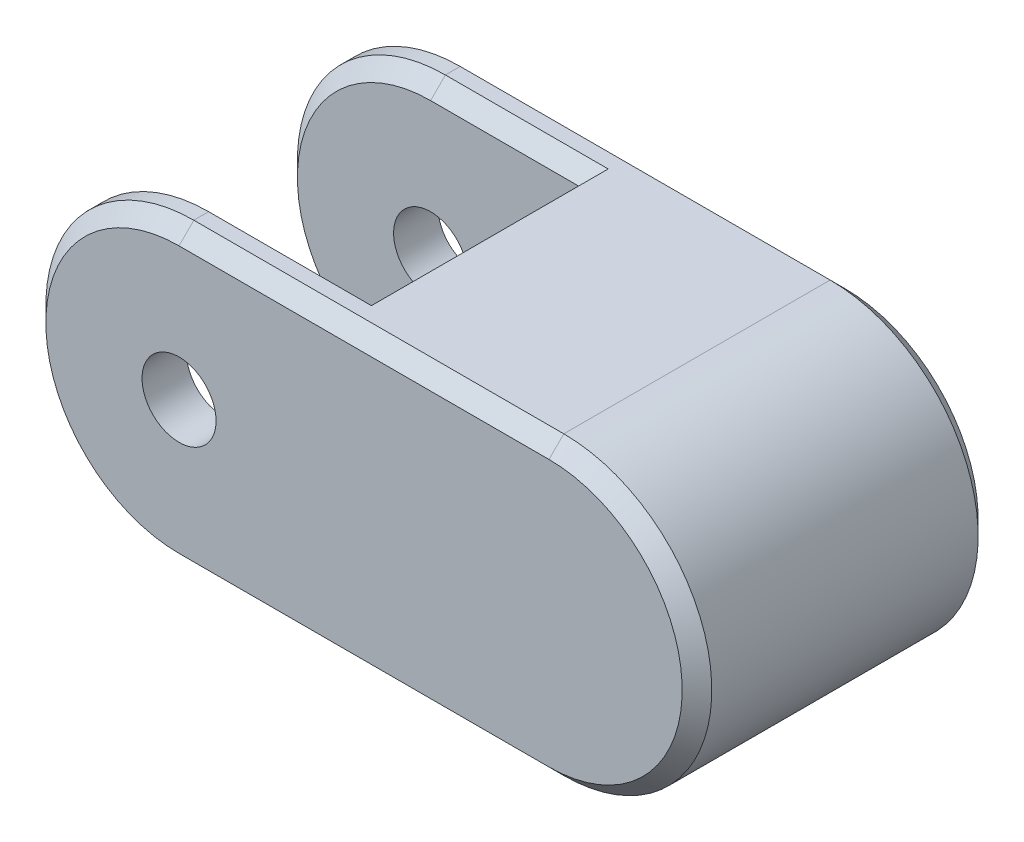
ISO-10303-21;
HEADER;
FILE_DESCRIPTION(('STEP AP214'),'2;1');
FILE_NAME('part.step','',(''),(''),'','','');
FILE_SCHEMA(('AUTOMOTIVE_DESIGN { 1 0 10303 214 1 1 1 1 }'));
ENDSEC;
DATA;
#1=APPLICATION_CONTEXT('core data for automotive mechanical design processes');
#2=APPLICATION_PROTOCOL_DEFINITION('international standard','automotive_design',2000,#1);
#3=PRODUCT_CONTEXT('',#1,'mechanical');
#4=PRODUCT('Part','Part','',(#3));
#5=PRODUCT_RELATED_PRODUCT_CATEGORY('part','',(#4));
#6=PRODUCT_DEFINITION_FORMATION('','',#4);
#7=PRODUCT_DEFINITION_CONTEXT('part definition',#1,'design');
#8=PRODUCT_DEFINITION('design','',#6,#7);
#9=PRODUCT_DEFINITION_SHAPE('','',#8);
#10=(LENGTH_UNIT() NAMED_UNIT(*) SI_UNIT(.MILLI.,.METRE.));
#11=(NAMED_UNIT(*) PLANE_ANGLE_UNIT() SI_UNIT($,.RADIAN.));
#12=(NAMED_UNIT(*) SI_UNIT($,.STERADIAN.) SOLID_ANGLE_UNIT());
#13=UNCERTAINTY_MEASURE_WITH_UNIT(LENGTH_MEASURE(1.E-05),#10,'distance_accuracy_value','');
#14=(GEOMETRIC_REPRESENTATION_CONTEXT(3) GLOBAL_UNCERTAINTY_ASSIGNED_CONTEXT((#13)) GLOBAL_UNIT_ASSIGNED_CONTEXT((#10,
#11,#12)) REPRESENTATION_CONTEXT('',''));
#15=CARTESIAN_POINT('',(0.,0.,0.));
#16=DIRECTION('',(0.,0.,1.));
#17=DIRECTION('',(1.,0.,0.));
#18=AXIS2_PLACEMENT_3D('',#15,#16,#17);
#19=CARTESIAN_POINT('',(-2.5,10.,-7.));
#20=DIRECTION('',(1.,0.,0.));
#21=DIRECTION('',(0.,0.,-1.));
#22=AXIS2_PLACEMENT_3D('',#19,#20,#21);
#23=PLANE('',#22);
#24=DIRECTION('',(0.,1.,0.));
#25=VECTOR('',#24,1.);
#26=CARTESIAN_POINT('',(-2.5,10.,-7.));
#27=LINE('',#26,#25);
#28=CARTESIAN_POINT('',(-2.5,-9.,-7.));
#29=VERTEX_POINT('',#28);
#30=CARTESIAN_POINT('',(-2.5,-7.,-7.));
#31=VERTEX_POINT('',#30);
#32=EDGE_CURVE('E210',#29,#31,#27,.T.);
#33=ORIENTED_EDGE('',*,*,#32,.F.);
#34=DIRECTION('',(0.,0.,1.));
#35=VECTOR('',#34,1.);
#36=CARTESIAN_POINT('',(-2.5,-9.,-7.));
#37=LINE('',#36,#35);
#38=CARTESIAN_POINT('',(-2.5,-8.99999999999999,7.));
#39=VERTEX_POINT('',#38);
#40=EDGE_CURVE('E292',#29,#39,#37,.T.);
#41=ORIENTED_EDGE('',*,*,#40,.T.);
#42=DIRECTION('',(0.,1.,0.));
#43=VECTOR('',#42,1.);
#44=CARTESIAN_POINT('',(-2.5,10.,7.));
#45=LINE('',#44,#43);
#46=CARTESIAN_POINT('',(-2.5,-7.,7.));
#47=VERTEX_POINT('',#46);
#48=EDGE_CURVE('E201',#39,#47,#45,.T.);
#49=ORIENTED_EDGE('',*,*,#48,.T.);
#50=DIRECTION('',(0.,0.,1.));
#51=VECTOR('',#50,1.);
#52=CARTESIAN_POINT('',(-2.5,-7.,-7.));
#53=LINE('',#52,#51);
#54=EDGE_CURVE('E194',#31,#47,#53,.T.);
#55=ORIENTED_EDGE('',*,*,#54,.F.);
#56=EDGE_LOOP('',(#33,#41,#49,#55));
#57=FACE_BOUND('',#56,.T.);
#58=ADVANCED_FACE('F34',(#57),#23,.F.);
#59=CARTESIAN_POINT('',(-12.5,0.,10.));
#60=DIRECTION('',(0.,0.,-1.));
#61=DIRECTION('',(-1.,0.,0.));
#62=AXIS2_PLACEMENT_3D('',#59,#60,#61);
#63=CYLINDRICAL_SURFACE('',#62,10.);
#64=DIRECTION('',(0.,0.,-1.));
#65=VECTOR('',#64,1.);
#66=CARTESIAN_POINT('',(-12.5,10.,10.));
#67=LINE('',#66,#65);
#68=CARTESIAN_POINT('',(-12.5,10.,-8.00000000000001));
#69=VERTEX_POINT('',#68);
#70=CARTESIAN_POINT('',(-12.5,10.,-9.));
#71=VERTEX_POINT('',#70);
#72=EDGE_CURVE('E215',#69,#71,#67,.T.);
#73=ORIENTED_EDGE('',*,*,#72,.T.);
#74=CARTESIAN_POINT('',(-12.5,0.,-9.));
#75=DIRECTION('',(0.,0.,1.));
#76=DIRECTION('',(1.,0.,0.));
#77=AXIS2_PLACEMENT_3D('',#74,#75,#76);
#78=CIRCLE('',#77,10.);
#79=CARTESIAN_POINT('',(-12.5,-10.,-9.));
#80=VERTEX_POINT('',#79);
#81=EDGE_CURVE('E290',#71,#80,#78,.T.);
#82=ORIENTED_EDGE('',*,*,#81,.T.);
#83=DIRECTION('',(0.,0.,-1.));
#84=VECTOR('',#83,1.);
#85=CARTESIAN_POINT('',(-12.5,-10.,10.));
#86=LINE('',#85,#84);
#87=CARTESIAN_POINT('',(-12.5,-10.,-8.00000000000001));
#88=VERTEX_POINT('',#87);
#89=EDGE_CURVE('E221',#88,#80,#86,.T.);
#90=ORIENTED_EDGE('',*,*,#89,.F.);
#91=CARTESIAN_POINT('',(-12.5,0.,-8.00000000000001));
#92=DIRECTION('',(0.,0.,1.));
#93=DIRECTION('',(1.,0.,0.));
#94=AXIS2_PLACEMENT_3D('',#91,#92,#93);
#95=CIRCLE('',#94,10.);
#96=EDGE_CURVE('E245',#88,#69,#95,.F.);
#97=ORIENTED_EDGE('',*,*,#96,.T.);
#98=EDGE_LOOP('',(#73,#82,#90,#97));
#99=FACE_BOUND('',#98,.T.);
#100=ADVANCED_FACE('F397',(#99),#63,.T.);
#101=CARTESIAN_POINT('',(-12.5,-10.,10.));
#102=DIRECTION('',(0.,1.,0.));
#103=DIRECTION('',(-1.,0.,0.));
#104=AXIS2_PLACEMENT_3D('',#101,#102,#103);
#105=PLANE('',#104);
#106=DIRECTION('',(1.,0.,0.));
#107=VECTOR('',#106,1.);
#108=CARTESIAN_POINT('',(-12.5,-10.,7.99999999999999));
#109=LINE('',#108,#107);
#110=CARTESIAN_POINT('',(-12.5,-10.,7.99999999999999));
#111=VERTEX_POINT('',#110);
#112=CARTESIAN_POINT('',(-1.49999999999999,-10.,7.99999999999999));
#113=VERTEX_POINT('',#112);
#114=EDGE_CURVE('E226',#111,#113,#109,.T.);
#115=ORIENTED_EDGE('',*,*,#114,.T.);
#116=DIRECTION('',(0.,0.,-1.));
#117=VECTOR('',#116,1.);
#118=CARTESIAN_POINT('',(-1.49999999999999,-10.,10.));
#119=LINE('',#118,#117);
#120=CARTESIAN_POINT('',(-1.49999999999999,-10.,-8.00000000000001));
#121=VERTEX_POINT('',#120);
#122=EDGE_CURVE('E319',#113,#121,#119,.T.);
#123=ORIENTED_EDGE('',*,*,#122,.T.);
#124=DIRECTION('',(-1.,0.,0.));
#125=VECTOR('',#124,1.);
#126=CARTESIAN_POINT('',(-12.5,-10.,-8.00000000000001));
#127=LINE('',#126,#125);
#128=EDGE_CURVE('E224',#121,#88,#127,.T.);
#129=ORIENTED_EDGE('',*,*,#128,.T.);
#130=ORIENTED_EDGE('',*,*,#89,.T.);
#131=DIRECTION('',(1.,0.,0.));
#132=VECTOR('',#131,1.);
#133=CARTESIAN_POINT('',(-12.5,-10.,-9.));
#134=LINE('',#133,#132);
#135=CARTESIAN_POINT('',(12.5,-10.,-9.));
#136=VERTEX_POINT('',#135);
#137=EDGE_CURVE('E265',#80,#136,#134,.T.);
#138=ORIENTED_EDGE('',*,*,#137,.T.);
#139=DIRECTION('',(0.,0.,-1.));
#140=VECTOR('',#139,1.);
#141=CARTESIAN_POINT('',(12.5,-10.,10.));
#142=LINE('',#141,#140);
#143=CARTESIAN_POINT('',(12.5,-10.,8.99999999999999));
#144=VERTEX_POINT('',#143);
#145=EDGE_CURVE('E218',#144,#136,#142,.T.);
#146=ORIENTED_EDGE('',*,*,#145,.F.);
#147=DIRECTION('',(-1.,0.,0.));
#148=VECTOR('',#147,1.);
#149=CARTESIAN_POINT('',(-12.5,-10.,8.99999999999999));
#150=LINE('',#149,#148);
#151=CARTESIAN_POINT('',(-12.5,-10.,8.99999999999999));
#152=VERTEX_POINT('',#151);
#153=EDGE_CURVE('E268',#144,#152,#150,.T.);
#154=ORIENTED_EDGE('',*,*,#153,.T.);
#155=EDGE_CURVE('E222',#152,#111,#86,.T.);
#156=ORIENTED_EDGE('',*,*,#155,.T.);
#157=EDGE_LOOP('',(#115,#123,#129,#130,#138,#146,#154,#156));
#158=FACE_BOUND('',#157,.T.);
#159=ADVANCED_FACE('F356',(#158),#105,.F.);
#160=CARTESIAN_POINT('',(-12.5,10.,10.));
#161=DIRECTION('',(0.,-1.,0.));
#162=DIRECTION('',(1.,0.,0.));
#163=AXIS2_PLACEMENT_3D('',#160,#161,#162);
#164=PLANE('',#163);
#165=DIRECTION('',(0.,0.,1.));
#166=VECTOR('',#165,1.);
#167=CARTESIAN_POINT('',(-1.5,10.,10.));
#168=LINE('',#167,#166);
#169=CARTESIAN_POINT('',(-1.5,10.,-8.00000000000001));
#170=VERTEX_POINT('',#169);
#171=CARTESIAN_POINT('',(-1.5,10.,7.99999999999999));
#172=VERTEX_POINT('',#171);
#173=EDGE_CURVE('E322',#170,#172,#168,.T.);
#174=ORIENTED_EDGE('',*,*,#173,.T.);
#175=DIRECTION('',(-1.,0.,0.));
#176=VECTOR('',#175,1.);
#177=CARTESIAN_POINT('',(-12.5,10.,7.99999999999999));
#178=LINE('',#177,#176);
#179=CARTESIAN_POINT('',(-12.5,10.,7.99999999999999));
#180=VERTEX_POINT('',#179);
#181=EDGE_CURVE('E49',#172,#180,#178,.T.);
#182=ORIENTED_EDGE('',*,*,#181,.T.);
#183=CARTESIAN_POINT('',(-12.5,10.,8.99999999999999));
#184=VERTEX_POINT('',#183);
#185=EDGE_CURVE('E212',#184,#180,#67,.T.);
#186=ORIENTED_EDGE('',*,*,#185,.F.);
#187=DIRECTION('',(1.,0.,0.));
#188=VECTOR('',#187,1.);
#189=CARTESIAN_POINT('',(12.5,10.,8.99999999999999));
#190=LINE('',#189,#188);
#191=CARTESIAN_POINT('',(12.5,10.,8.99999999999999));
#192=VERTEX_POINT('',#191);
#193=EDGE_CURVE('E279',#184,#192,#190,.T.);
#194=ORIENTED_EDGE('',*,*,#193,.T.);
#195=DIRECTION('',(0.,0.,-1.));
#196=VECTOR('',#195,1.);
#197=CARTESIAN_POINT('',(12.5,10.,10.));
#198=LINE('',#197,#196);
#199=CARTESIAN_POINT('',(12.5,10.,-9.));
#200=VERTEX_POINT('',#199);
#201=EDGE_CURVE('E214',#192,#200,#198,.T.);
#202=ORIENTED_EDGE('',*,*,#201,.T.);
#203=DIRECTION('',(-1.,0.,0.));
#204=VECTOR('',#203,1.);
#205=CARTESIAN_POINT('',(-12.5,10.,-9.));
#206=LINE('',#205,#204);
#207=EDGE_CURVE('E277',#200,#71,#206,.T.);
#208=ORIENTED_EDGE('',*,*,#207,.T.);
#209=ORIENTED_EDGE('',*,*,#72,.F.);
#210=DIRECTION('',(1.,0.,0.));
#211=VECTOR('',#210,1.);
#212=CARTESIAN_POINT('',(-2.5,10.,-8.00000000000001));
#213=LINE('',#212,#211);
#214=EDGE_CURVE('E57',#69,#170,#213,.T.);
#215=ORIENTED_EDGE('',*,*,#214,.T.);
#216=EDGE_LOOP('',(#174,#182,#186,#194,#202,#208,#209,#215));
#217=FACE_BOUND('',#216,.T.);
#218=ADVANCED_FACE('F334',(#217),#164,.F.);
#219=ORIENTED_EDGE('',*,*,#155,.F.);
#220=CARTESIAN_POINT('',(-12.5,0.,8.99999999999999));
#221=DIRECTION('',(0.,0.,1.));
#222=DIRECTION('',(1.,0.,0.));
#223=AXIS2_PLACEMENT_3D('',#220,#221,#222);
#224=CIRCLE('',#223,10.);
#225=EDGE_CURVE('E275',#152,#184,#224,.F.);
#226=ORIENTED_EDGE('',*,*,#225,.T.);
#227=ORIENTED_EDGE('',*,*,#185,.T.);
#228=CARTESIAN_POINT('',(-12.5,0.,7.99999999999999));
#229=DIRECTION('',(0.,0.,1.));
#230=DIRECTION('',(1.,0.,0.));
#231=AXIS2_PLACEMENT_3D('',#228,#229,#230);
#232=CIRCLE('',#231,10.);
#233=EDGE_CURVE('E233',#180,#111,#232,.T.);
#234=ORIENTED_EDGE('',*,*,#233,.T.);
#235=EDGE_LOOP('',(#219,#226,#227,#234));
#236=FACE_BOUND('',#235,.T.);
#237=ADVANCED_FACE('F345',(#236),#63,.T.);
#238=CARTESIAN_POINT('',(12.5,0.,10.));
#239=DIRECTION('',(0.,0.,-1.));
#240=DIRECTION('',(-1.,0.,0.));
#241=AXIS2_PLACEMENT_3D('',#238,#239,#240);
#242=CYLINDRICAL_SURFACE('',#241,10.);
#243=ORIENTED_EDGE('',*,*,#201,.F.);
#244=CARTESIAN_POINT('',(12.5,0.,8.99999999999999));
#245=DIRECTION('',(0.,0.,1.));
#246=DIRECTION('',(1.,0.,0.));
#247=AXIS2_PLACEMENT_3D('',#244,#245,#246);
#248=CIRCLE('',#247,10.);
#249=EDGE_CURVE('E273',#192,#144,#248,.F.);
#250=ORIENTED_EDGE('',*,*,#249,.T.);
#251=ORIENTED_EDGE('',*,*,#145,.T.);
#252=CARTESIAN_POINT('',(12.5,0.,-9.));
#253=DIRECTION('',(0.,0.,1.));
#254=DIRECTION('',(1.,0.,0.));
#255=AXIS2_PLACEMENT_3D('',#252,#253,#254);
#256=CIRCLE('',#255,10.);
#257=EDGE_CURVE('E271',#136,#200,#256,.T.);
#258=ORIENTED_EDGE('',*,*,#257,.T.);
#259=EDGE_LOOP('',(#243,#250,#251,#258));
#260=FACE_BOUND('',#259,.T.);
#261=ADVANCED_FACE('F373',(#260),#242,.T.);
#262=CARTESIAN_POINT('',(-12.5,0.,10.));
#263=DIRECTION('',(0.,0.,1.));
#264=DIRECTION('',(1.,0.,0.));
#265=AXIS2_PLACEMENT_3D('',#262,#263,#264);
#266=PLANE('',#265);
#267=CARTESIAN_POINT('',(-12.5,0.,10.));
#268=DIRECTION('',(0.,0.,1.));
#269=DIRECTION('',(1.,0.,0.));
#270=AXIS2_PLACEMENT_3D('',#267,#268,#269);
#271=CIRCLE('',#270,2.5);
#272=CARTESIAN_POINT('',(-10.,0.,10.));
#273=VERTEX_POINT('',#272);
#274=EDGE_CURVE('E439',#273,#273,#271,.T.);
#275=ORIENTED_EDGE('',*,*,#274,.F.);
#276=EDGE_LOOP('',(#275));
#277=FACE_BOUND('',#276,.T.);
#278=CARTESIAN_POINT('',(-12.5,0.,10.));
#279=DIRECTION('',(0.,0.,1.));
#280=DIRECTION('',(1.,0.,0.));
#281=AXIS2_PLACEMENT_3D('',#278,#279,#280);
#282=CIRCLE('',#281,9.00000000000001);
#283=CARTESIAN_POINT('',(-12.5,9.00000000000001,10.));
#284=VERTEX_POINT('',#283);
#285=CARTESIAN_POINT('',(-12.5,-9.00000000000001,10.));
#286=VERTEX_POINT('',#285);
#287=EDGE_CURVE('E258',#284,#286,#282,.T.);
#288=ORIENTED_EDGE('',*,*,#287,.T.);
#289=DIRECTION('',(1.,0.,0.));
#290=VECTOR('',#289,1.);
#291=CARTESIAN_POINT('',(12.5,-9.,10.));
#292=LINE('',#291,#290);
#293=CARTESIAN_POINT('',(12.5,-9.,10.));
#294=VERTEX_POINT('',#293);
#295=EDGE_CURVE('E262',#286,#294,#292,.T.);
#296=ORIENTED_EDGE('',*,*,#295,.T.);
#297=CARTESIAN_POINT('',(12.5,0.,10.));
#298=DIRECTION('',(0.,0.,1.));
#299=DIRECTION('',(1.,0.,0.));
#300=AXIS2_PLACEMENT_3D('',#297,#298,#299);
#301=CIRCLE('',#300,9.00000000000001);
#302=CARTESIAN_POINT('',(12.5,9.00000000000001,10.));
#303=VERTEX_POINT('',#302);
#304=EDGE_CURVE('E260',#294,#303,#301,.T.);
#305=ORIENTED_EDGE('',*,*,#304,.T.);
#306=DIRECTION('',(-1.,0.,0.));
#307=VECTOR('',#306,1.);
#308=CARTESIAN_POINT('',(-12.5,9.00000000000001,10.));
#309=LINE('',#308,#307);
#310=EDGE_CURVE('E247',#303,#284,#309,.T.);
#311=ORIENTED_EDGE('',*,*,#310,.T.);
#312=EDGE_LOOP('',(#288,#296,#305,#311));
#313=FACE_BOUND('',#312,.T.);
#314=ADVANCED_FACE('F367',(#277,#313),#266,.T.);
#315=CARTESIAN_POINT('',(-12.5,0.,-10.));
#316=DIRECTION('',(0.,0.,1.));
#317=DIRECTION('',(1.,0.,0.));
#318=AXIS2_PLACEMENT_3D('',#315,#316,#317);
#319=PLANE('',#318);
#320=CARTESIAN_POINT('',(-12.5,0.,-10.));
#321=DIRECTION('',(0.,0.,1.));
#322=DIRECTION('',(1.,0.,0.));
#323=AXIS2_PLACEMENT_3D('',#320,#321,#322);
#324=CIRCLE('',#323,2.5);
#325=CARTESIAN_POINT('',(-10.,0.,-10.));
#326=VERTEX_POINT('',#325);
#327=EDGE_CURVE('E316',#326,#326,#324,.T.);
#328=ORIENTED_EDGE('',*,*,#327,.T.);
#329=EDGE_LOOP('',(#328));
#330=FACE_BOUND('',#329,.T.);
#331=CARTESIAN_POINT('',(12.5,0.,-10.));
#332=DIRECTION('',(0.,0.,1.));
#333=DIRECTION('',(1.,0.,0.));
#334=AXIS2_PLACEMENT_3D('',#331,#332,#333);
#335=CIRCLE('',#334,9.);
#336=CARTESIAN_POINT('',(12.5,9.00000000000001,-10.));
#337=VERTEX_POINT('',#336);
#338=CARTESIAN_POINT('',(12.5,-9.,-10.));
#339=VERTEX_POINT('',#338);
#340=EDGE_CURVE('E285',#337,#339,#335,.F.);
#341=ORIENTED_EDGE('',*,*,#340,.T.);
#342=DIRECTION('',(-1.,0.,0.));
#343=VECTOR('',#342,1.);
#344=CARTESIAN_POINT('',(-12.5,-9.,-10.));
#345=LINE('',#344,#343);
#346=CARTESIAN_POINT('',(-12.5,-9.,-10.));
#347=VERTEX_POINT('',#346);
#348=EDGE_CURVE('E287',#339,#347,#345,.T.);
#349=ORIENTED_EDGE('',*,*,#348,.T.);
#350=CARTESIAN_POINT('',(-12.5,0.,-10.));
#351=DIRECTION('',(0.,0.,1.));
#352=DIRECTION('',(1.,0.,0.));
#353=AXIS2_PLACEMENT_3D('',#350,#351,#352);
#354=CIRCLE('',#353,9.);
#355=CARTESIAN_POINT('',(-12.5,9.,-10.));
#356=VERTEX_POINT('',#355);
#357=EDGE_CURVE('E283',#347,#356,#354,.F.);
#358=ORIENTED_EDGE('',*,*,#357,.T.);
#359=DIRECTION('',(1.,0.,0.));
#360=VECTOR('',#359,1.);
#361=CARTESIAN_POINT('',(-12.5,9.,-10.));
#362=LINE('',#361,#360);
#363=EDGE_CURVE('E281',#356,#337,#362,.T.);
#364=ORIENTED_EDGE('',*,*,#363,.T.);
#365=EDGE_LOOP('',(#341,#349,#358,#364));
#366=FACE_BOUND('',#365,.T.);
#367=ADVANCED_FACE('F389',(#330,#366),#319,.F.);
#368=CARTESIAN_POINT('',(-2.5,7.,7.));
#369=VERTEX_POINT('',#368);
#370=CARTESIAN_POINT('',(-2.5,9.,7.));
#371=VERTEX_POINT('',#370);
#372=EDGE_CURVE('E190',#369,#371,#45,.T.);
#373=ORIENTED_EDGE('',*,*,#372,.T.);
#374=DIRECTION('',(0.,0.,-1.));
#375=VECTOR('',#374,1.);
#376=CARTESIAN_POINT('',(-2.5,9.,-7.));
#377=LINE('',#376,#375);
#378=CARTESIAN_POINT('',(-2.5,9.,-7.));
#379=VERTEX_POINT('',#378);
#380=EDGE_CURVE('E324',#371,#379,#377,.T.);
#381=ORIENTED_EDGE('',*,*,#380,.T.);
#382=CARTESIAN_POINT('',(-2.5,7.,-7.));
#383=VERTEX_POINT('',#382);
#384=EDGE_CURVE('E193',#383,#379,#27,.T.);
#385=ORIENTED_EDGE('',*,*,#384,.F.);
#386=DIRECTION('',(0.,0.,1.));
#387=VECTOR('',#386,1.);
#388=CARTESIAN_POINT('',(-2.5,7.,10.));
#389=LINE('',#388,#387);
#390=EDGE_CURVE('E178',#383,#369,#389,.T.);
#391=ORIENTED_EDGE('',*,*,#390,.T.);
#392=EDGE_LOOP('',(#373,#381,#385,#391));
#393=FACE_BOUND('',#392,.T.);
#394=ADVANCED_FACE('F189',(#393),#23,.F.);
#395=CARTESIAN_POINT('',(-12.5,0.,-7.));
#396=DIRECTION('',(0.,0.,1.));
#397=DIRECTION('',(1.,0.,0.));
#398=AXIS2_PLACEMENT_3D('',#395,#396,#397);
#399=PLANE('',#398);
#400=CARTESIAN_POINT('',(-12.5,0.,-7.));
#401=DIRECTION('',(0.,0.,1.));
#402=DIRECTION('',(1.,0.,0.));
#403=AXIS2_PLACEMENT_3D('',#400,#401,#402);
#404=CIRCLE('',#403,2.5);
#405=CARTESIAN_POINT('',(-10.,0.,-7.));
#406=VERTEX_POINT('',#405);
#407=EDGE_CURVE('E306',#406,#406,#404,.T.);
#408=ORIENTED_EDGE('',*,*,#407,.F.);
#409=EDGE_LOOP('',(#408));
#410=FACE_BOUND('',#409,.T.);
#411=CARTESIAN_POINT('',(-12.5,0.,-7.));
#412=DIRECTION('',(0.,0.,1.));
#413=DIRECTION('',(1.,0.,0.));
#414=AXIS2_PLACEMENT_3D('',#411,#412,#413);
#415=CIRCLE('',#414,9.);
#416=CARTESIAN_POINT('',(-12.5,9.,-7.));
#417=VERTEX_POINT('',#416);
#418=CARTESIAN_POINT('',(-12.5,-9.,-7.));
#419=VERTEX_POINT('',#418);
#420=EDGE_CURVE('E240',#417,#419,#415,.T.);
#421=ORIENTED_EDGE('',*,*,#420,.T.);
#422=DIRECTION('',(1.,0.,0.));
#423=VECTOR('',#422,1.);
#424=CARTESIAN_POINT('',(-2.5,-9.,-7.));
#425=LINE('',#424,#423);
#426=EDGE_CURVE('E242',#419,#29,#425,.T.);
#427=ORIENTED_EDGE('',*,*,#426,.T.);
#428=ORIENTED_EDGE('',*,*,#32,.T.);
#429=DIRECTION('',(1.,0.,0.));
#430=VECTOR('',#429,1.);
#431=CARTESIAN_POINT('',(-12.5,-7.,-7.));
#432=LINE('',#431,#430);
#433=CARTESIAN_POINT('',(12.5,-7.,-7.));
#434=VERTEX_POINT('',#433);
#435=EDGE_CURVE('E432',#31,#434,#432,.T.);
#436=ORIENTED_EDGE('',*,*,#435,.T.);
#437=CARTESIAN_POINT('',(12.5,0.,-7.));
#438=DIRECTION('',(0.,0.,1.));
#439=DIRECTION('',(1.,0.,0.));
#440=AXIS2_PLACEMENT_3D('',#437,#438,#439);
#441=CIRCLE('',#440,7.);
#442=CARTESIAN_POINT('',(12.5,7.00000000000001,-7.));
#443=VERTEX_POINT('',#442);
#444=EDGE_CURVE('E436',#434,#443,#441,.T.);
#445=ORIENTED_EDGE('',*,*,#444,.T.);
#446=DIRECTION('',(1.,0.,0.));
#447=VECTOR('',#446,1.);
#448=CARTESIAN_POINT('',(-12.5,7.,-7.));
#449=LINE('',#448,#447);
#450=EDGE_CURVE('E406',#383,#443,#449,.T.);
#451=ORIENTED_EDGE('',*,*,#450,.F.);
#452=ORIENTED_EDGE('',*,*,#384,.T.);
#453=DIRECTION('',(-1.,0.,0.));
#454=VECTOR('',#453,1.);
#455=CARTESIAN_POINT('',(-12.5,9.,-7.));
#456=LINE('',#455,#454);
#457=EDGE_CURVE('E238',#379,#417,#456,.T.);
#458=ORIENTED_EDGE('',*,*,#457,.T.);
#459=EDGE_LOOP('',(#421,#427,#428,#436,#445,#451,#452,#458));
#460=FACE_BOUND('',#459,.T.);
#461=ADVANCED_FACE('F404',(#410,#460),#399,.T.);
#462=CARTESIAN_POINT('',(-12.5,0.,7.));
#463=DIRECTION('',(0.,0.,1.));
#464=DIRECTION('',(1.,0.,0.));
#465=AXIS2_PLACEMENT_3D('',#462,#463,#464);
#466=PLANE('',#465);
#467=CARTESIAN_POINT('',(-12.5,0.,7.));
#468=DIRECTION('',(0.,0.,1.));
#469=DIRECTION('',(1.,0.,0.));
#470=AXIS2_PLACEMENT_3D('',#467,#468,#469);
#471=CIRCLE('',#470,2.5);
#472=CARTESIAN_POINT('',(-10.,0.,7.));
#473=VERTEX_POINT('',#472);
#474=EDGE_CURVE('E313',#473,#473,#471,.T.);
#475=ORIENTED_EDGE('',*,*,#474,.T.);
#476=EDGE_LOOP('',(#475));
#477=FACE_BOUND('',#476,.T.);
#478=ORIENTED_EDGE('',*,*,#48,.F.);
#479=DIRECTION('',(-1.,0.,0.));
#480=VECTOR('',#479,1.);
#481=CARTESIAN_POINT('',(-12.5,-8.99999999999999,7.));
#482=LINE('',#481,#480);
#483=CARTESIAN_POINT('',(-12.5,-8.99999999999999,7.));
#484=VERTEX_POINT('',#483);
#485=EDGE_CURVE('E231',#39,#484,#482,.T.);
#486=ORIENTED_EDGE('',*,*,#485,.T.);
#487=CARTESIAN_POINT('',(-12.5,0.,7.));
#488=DIRECTION('',(0.,0.,1.));
#489=DIRECTION('',(1.,0.,0.));
#490=AXIS2_PLACEMENT_3D('',#487,#488,#489);
#491=CIRCLE('',#490,8.99999999999999);
#492=CARTESIAN_POINT('',(-12.5,8.99999999999999,7.));
#493=VERTEX_POINT('',#492);
#494=EDGE_CURVE('E229',#484,#493,#491,.F.);
#495=ORIENTED_EDGE('',*,*,#494,.T.);
#496=DIRECTION('',(1.,0.,0.));
#497=VECTOR('',#496,1.);
#498=CARTESIAN_POINT('',(-12.5,8.99999999999999,7.));
#499=LINE('',#498,#497);
#500=EDGE_CURVE('E199',#493,#371,#499,.T.);
#501=ORIENTED_EDGE('',*,*,#500,.T.);
#502=ORIENTED_EDGE('',*,*,#372,.F.);
#503=DIRECTION('',(-1.,0.,0.));
#504=VECTOR('',#503,1.);
#505=CARTESIAN_POINT('',(-12.5,7.,7.));
#506=LINE('',#505,#504);
#507=CARTESIAN_POINT('',(12.5,7.00000000000001,7.));
#508=VERTEX_POINT('',#507);
#509=EDGE_CURVE('E174',#508,#369,#506,.T.);
#510=ORIENTED_EDGE('',*,*,#509,.F.);
#511=CARTESIAN_POINT('',(12.5,0.,7.));
#512=DIRECTION('',(0.,0.,1.));
#513=DIRECTION('',(1.,0.,0.));
#514=AXIS2_PLACEMENT_3D('',#511,#512,#513);
#515=CIRCLE('',#514,7.);
#516=CARTESIAN_POINT('',(12.5,-7.,7.));
#517=VERTEX_POINT('',#516);
#518=EDGE_CURVE('E427',#508,#517,#515,.F.);
#519=ORIENTED_EDGE('',*,*,#518,.T.);
#520=DIRECTION('',(-1.,0.,0.));
#521=VECTOR('',#520,1.);
#522=CARTESIAN_POINT('',(-12.5,-7.,7.));
#523=LINE('',#522,#521);
#524=EDGE_CURVE('E184',#517,#47,#523,.T.);
#525=ORIENTED_EDGE('',*,*,#524,.T.);
#526=EDGE_LOOP('',(#478,#486,#495,#501,#502,#510,#519,#525));
#527=FACE_BOUND('',#526,.T.);
#528=ADVANCED_FACE('F197',(#477,#527),#466,.F.);
#529=CARTESIAN_POINT('',(-12.5,10.,7.99999999999999));
#530=DIRECTION('',(0.,-0.707106781186542,0.707106781186553));
#531=DIRECTION('',(0.,-0.707106781186553,-0.707106781186542));
#532=AXIS2_PLACEMENT_3D('',#529,#530,#531);
#533=PLANE('',#532);
#534=ORIENTED_EDGE('',*,*,#181,.F.);
#535=DIRECTION('',(-0.577350269189626,-0.57735026918963,-0.577350269189621));
#536=VECTOR('',#535,1.);
#537=CARTESIAN_POINT('',(-0.833333333333335,10.6666666666667,8.66666666666665));
#538=LINE('',#537,#536);
#539=EDGE_CURVE('E42',#172,#371,#538,.T.);
#540=ORIENTED_EDGE('',*,*,#539,.T.);
#541=ORIENTED_EDGE('',*,*,#500,.F.);
#542=DIRECTION('',(0.,-0.707106781186553,-0.707106781186542));
#543=VECTOR('',#542,1.);
#544=CARTESIAN_POINT('',(-12.5,10.,7.99999999999999));
#545=LINE('',#544,#543);
#546=EDGE_CURVE('E202',#180,#493,#545,.T.);
#547=ORIENTED_EDGE('',*,*,#546,.F.);
#548=EDGE_LOOP('',(#534,#540,#541,#547));
#549=FACE_BOUND('',#548,.T.);
#550=ADVANCED_FACE('F330',(#549),#533,.F.);
#551=CARTESIAN_POINT('',(-12.5,0.,7.99999999999999));
#552=DIRECTION('',(0.,0.,1.));
#553=DIRECTION('',(1.,0.,0.));
#554=AXIS2_PLACEMENT_3D('',#551,#552,#553);
#555=CONICAL_SURFACE('',#554,10.,0.785398163397456);
#556=ORIENTED_EDGE('',*,*,#546,.T.);
#557=ORIENTED_EDGE('',*,*,#494,.F.);
#558=DIRECTION('',(0.,0.707106781186553,-0.707106781186542));
#559=VECTOR('',#558,1.);
#560=CARTESIAN_POINT('',(-12.5,-10.,7.99999999999999));
#561=LINE('',#560,#559);
#562=EDGE_CURVE('E206',#111,#484,#561,.T.);
#563=ORIENTED_EDGE('',*,*,#562,.F.);
#564=ORIENTED_EDGE('',*,*,#233,.F.);
#565=EDGE_LOOP('',(#556,#557,#563,#564));
#566=FACE_BOUND('',#565,.T.);
#567=ADVANCED_FACE('F341',(#566),#555,.T.);
#568=CARTESIAN_POINT('',(-12.5,-10.,7.99999999999999));
#569=DIRECTION('',(0.,0.707106781186542,0.707106781186553));
#570=DIRECTION('',(0.,-0.707106781186553,0.707106781186542));
#571=AXIS2_PLACEMENT_3D('',#568,#569,#570);
#572=PLANE('',#571);
#573=ORIENTED_EDGE('',*,*,#562,.T.);
#574=ORIENTED_EDGE('',*,*,#485,.F.);
#575=DIRECTION('',(0.577350269189631,-0.577350269189627,0.577350269189619));
#576=VECTOR('',#575,1.);
#577=CARTESIAN_POINT('',(-7.16666666666666,-4.33333333333338,2.33333333333345));
#578=LINE('',#577,#576);
#579=EDGE_CURVE('E326',#39,#113,#578,.T.);
#580=ORIENTED_EDGE('',*,*,#579,.T.);
#581=ORIENTED_EDGE('',*,*,#114,.F.);
#582=EDGE_LOOP('',(#573,#574,#580,#581));
#583=FACE_BOUND('',#582,.T.);
#584=ADVANCED_FACE('F424',(#583),#572,.F.);
#585=CARTESIAN_POINT('',(-12.5,9.,-7.));
#586=DIRECTION('',(0.,0.70710678118655,0.707106781186545));
#587=DIRECTION('',(0.,-0.707106781186545,0.70710678118655));
#588=AXIS2_PLACEMENT_3D('',#585,#586,#587);
#589=PLANE('',#588);
#590=ORIENTED_EDGE('',*,*,#457,.F.);
#591=DIRECTION('',(-0.577350269189622,-0.577350269189626,0.57735026918963));
#592=VECTOR('',#591,1.);
#593=CARTESIAN_POINT('',(-7.5,3.99999999999996,-1.99999999999992));
#594=LINE('',#593,#592);
#595=EDGE_CURVE('E11',#379,#170,#594,.F.);
#596=ORIENTED_EDGE('',*,*,#595,.T.);
#597=ORIENTED_EDGE('',*,*,#214,.F.);
#598=DIRECTION('',(0.,0.707106781186545,-0.70710678118655));
#599=VECTOR('',#598,1.);
#600=CARTESIAN_POINT('',(-12.5,9.,-7.));
#601=LINE('',#600,#599);
#602=EDGE_CURVE('E249',#417,#69,#601,.T.);
#603=ORIENTED_EDGE('',*,*,#602,.F.);
#604=EDGE_LOOP('',(#590,#596,#597,#603));
#605=FACE_BOUND('',#604,.T.);
#606=ADVANCED_FACE('F408',(#605),#589,.T.);
#607=CARTESIAN_POINT('',(-12.5,0.,-7.));
#608=DIRECTION('',(0.,0.,-1.));
#609=DIRECTION('',(-1.,0.,0.));
#610=AXIS2_PLACEMENT_3D('',#607,#608,#609);
#611=CONICAL_SURFACE('',#610,9.,0.785398163397445);
#612=ORIENTED_EDGE('',*,*,#602,.T.);
#613=ORIENTED_EDGE('',*,*,#96,.F.);
#614=DIRECTION('',(0.,-0.707106781186545,-0.70710678118655));
#615=VECTOR('',#614,1.);
#616=CARTESIAN_POINT('',(-12.5,-9.,-7.));
#617=LINE('',#616,#615);
#618=EDGE_CURVE('E251',#419,#88,#617,.T.);
#619=ORIENTED_EDGE('',*,*,#618,.F.);
#620=ORIENTED_EDGE('',*,*,#420,.F.);
#621=EDGE_LOOP('',(#612,#613,#619,#620));
#622=FACE_BOUND('',#621,.T.);
#623=ADVANCED_FACE('F412',(#622),#611,.T.);
#624=CARTESIAN_POINT('',(-12.5,-9.,-7.));
#625=DIRECTION('',(0.,-0.70710678118655,0.707106781186545));
#626=DIRECTION('',(0.,-0.707106781186545,-0.70710678118655));
#627=AXIS2_PLACEMENT_3D('',#624,#625,#626);
#628=PLANE('',#627);
#629=ORIENTED_EDGE('',*,*,#618,.T.);
#630=ORIENTED_EDGE('',*,*,#128,.F.);
#631=DIRECTION('',(0.577350269189627,-0.577350269189623,-0.577350269189627));
#632=VECTOR('',#631,1.);
#633=CARTESIAN_POINT('',(-2.5,-9.,-7.));
#634=LINE('',#633,#632);
#635=EDGE_CURVE('E329',#121,#29,#634,.F.);
#636=ORIENTED_EDGE('',*,*,#635,.T.);
#637=ORIENTED_EDGE('',*,*,#426,.F.);
#638=EDGE_LOOP('',(#629,#630,#636,#637));
#639=FACE_BOUND('',#638,.T.);
#640=ADVANCED_FACE('F484',(#639),#628,.T.);
#641=CARTESIAN_POINT('',(-12.5,9.00000000000001,10.));
#642=DIRECTION('',(0.,0.707106781186552,0.707106781186543));
#643=DIRECTION('',(0.,-0.707106781186543,0.707106781186552));
#644=AXIS2_PLACEMENT_3D('',#641,#642,#643);
#645=PLANE('',#644);
#646=DIRECTION('',(0.,-0.707106781186543,0.707106781186552));
#647=VECTOR('',#646,1.);
#648=CARTESIAN_POINT('',(12.5,10.,8.99999999999999));
#649=LINE('',#648,#647);
#650=EDGE_CURVE('E298',#192,#303,#649,.T.);
#651=ORIENTED_EDGE('',*,*,#650,.F.);
#652=ORIENTED_EDGE('',*,*,#193,.F.);
#653=DIRECTION('',(0.,0.707106781186543,-0.707106781186552));
#654=VECTOR('',#653,1.);
#655=CARTESIAN_POINT('',(-12.5,9.00000000000001,10.));
#656=LINE('',#655,#654);
#657=EDGE_CURVE('E254',#284,#184,#656,.T.);
#658=ORIENTED_EDGE('',*,*,#657,.F.);
#659=ORIENTED_EDGE('',*,*,#310,.F.);
#660=EDGE_LOOP('',(#651,#652,#658,#659));
#661=FACE_BOUND('',#660,.T.);
#662=ADVANCED_FACE('F369',(#661),#645,.T.);
#663=CARTESIAN_POINT('',(-12.5,0.,10.));
#664=DIRECTION('',(0.,0.,-1.));
#665=DIRECTION('',(-1.,0.,0.));
#666=AXIS2_PLACEMENT_3D('',#663,#664,#665);
#667=CONICAL_SURFACE('',#666,9.00000000000001,0.785398163397441);
#668=ORIENTED_EDGE('',*,*,#657,.T.);
#669=ORIENTED_EDGE('',*,*,#225,.F.);
#670=DIRECTION('',(0.,-0.707106781186543,-0.707106781186552));
#671=VECTOR('',#670,1.);
#672=CARTESIAN_POINT('',(-12.5,-9.00000000000001,10.));
#673=LINE('',#672,#671);
#674=EDGE_CURVE('E295',#286,#152,#673,.T.);
#675=ORIENTED_EDGE('',*,*,#674,.F.);
#676=ORIENTED_EDGE('',*,*,#287,.F.);
#677=EDGE_LOOP('',(#668,#669,#675,#676));
#678=FACE_BOUND('',#677,.T.);
#679=ADVANCED_FACE('F349',(#678),#667,.T.);
#680=CARTESIAN_POINT('',(12.5,0.,10.));
#681=DIRECTION('',(0.,0.,-1.));
#682=DIRECTION('',(-1.,0.,0.));
#683=AXIS2_PLACEMENT_3D('',#680,#681,#682);
#684=CONICAL_SURFACE('',#683,9.00000000000001,0.785398163397441);
#685=ORIENTED_EDGE('',*,*,#650,.T.);
#686=ORIENTED_EDGE('',*,*,#304,.F.);
#687=DIRECTION('',(0.,0.707106781186543,0.707106781186552));
#688=VECTOR('',#687,1.);
#689=CARTESIAN_POINT('',(12.5,-10.,8.99999999999999));
#690=LINE('',#689,#688);
#691=EDGE_CURVE('E293',#144,#294,#690,.T.);
#692=ORIENTED_EDGE('',*,*,#691,.F.);
#693=ORIENTED_EDGE('',*,*,#249,.F.);
#694=EDGE_LOOP('',(#685,#686,#692,#693));
#695=FACE_BOUND('',#694,.T.);
#696=ADVANCED_FACE('F363',(#695),#684,.T.);
#697=CARTESIAN_POINT('',(-12.5,-9.00000000000001,10.));
#698=DIRECTION('',(0.,-0.707106781186552,0.707106781186543));
#699=DIRECTION('',(0.,-0.707106781186543,-0.707106781186552));
#700=AXIS2_PLACEMENT_3D('',#697,#698,#699);
#701=PLANE('',#700);
#702=ORIENTED_EDGE('',*,*,#674,.T.);
#703=ORIENTED_EDGE('',*,*,#153,.F.);
#704=ORIENTED_EDGE('',*,*,#691,.T.);
#705=ORIENTED_EDGE('',*,*,#295,.F.);
#706=EDGE_LOOP('',(#702,#703,#704,#705));
#707=FACE_BOUND('',#706,.T.);
#708=ADVANCED_FACE('F359',(#707),#701,.T.);
#709=CARTESIAN_POINT('',(-12.5,10.,-9.));
#710=DIRECTION('',(0.,-0.707106781186547,0.707106781186547));
#711=DIRECTION('',(0.,-0.707106781186548,-0.707106781186548));
#712=AXIS2_PLACEMENT_3D('',#709,#710,#711);
#713=PLANE('',#712);
#714=DIRECTION('',(0.,0.707106781186547,0.707106781186547));
#715=VECTOR('',#714,1.);
#716=CARTESIAN_POINT('',(12.5,9.00000000000001,-10.));
#717=LINE('',#716,#715);
#718=EDGE_CURVE('E308',#337,#200,#717,.T.);
#719=ORIENTED_EDGE('',*,*,#718,.F.);
#720=ORIENTED_EDGE('',*,*,#363,.F.);
#721=DIRECTION('',(0.,-0.707106781186547,-0.707106781186547));
#722=VECTOR('',#721,1.);
#723=CARTESIAN_POINT('',(-12.5,10.,-9.));
#724=LINE('',#723,#722);
#725=EDGE_CURVE('E296',#71,#356,#724,.T.);
#726=ORIENTED_EDGE('',*,*,#725,.F.);
#727=ORIENTED_EDGE('',*,*,#207,.F.);
#728=EDGE_LOOP('',(#719,#720,#726,#727));
#729=FACE_BOUND('',#728,.T.);
#730=ADVANCED_FACE('F393',(#729),#713,.F.);
#731=CARTESIAN_POINT('',(-12.5,0.,-9.));
#732=DIRECTION('',(0.,0.,1.));
#733=DIRECTION('',(1.,0.,0.));
#734=AXIS2_PLACEMENT_3D('',#731,#732,#733);
#735=CONICAL_SURFACE('',#734,10.,0.785398163397448);
#736=ORIENTED_EDGE('',*,*,#725,.T.);
#737=ORIENTED_EDGE('',*,*,#357,.F.);
#738=DIRECTION('',(0.,0.707106781186547,-0.707106781186547));
#739=VECTOR('',#738,1.);
#740=CARTESIAN_POINT('',(-12.5,-10.,-9.));
#741=LINE('',#740,#739);
#742=EDGE_CURVE('E305',#80,#347,#741,.T.);
#743=ORIENTED_EDGE('',*,*,#742,.F.);
#744=ORIENTED_EDGE('',*,*,#81,.F.);
#745=EDGE_LOOP('',(#736,#737,#743,#744));
#746=FACE_BOUND('',#745,.T.);
#747=ADVANCED_FACE('F504',(#746),#735,.T.);
#748=CARTESIAN_POINT('',(12.5,0.,-9.));
#749=DIRECTION('',(0.,0.,1.));
#750=DIRECTION('',(1.,0.,0.));
#751=AXIS2_PLACEMENT_3D('',#748,#749,#750);
#752=CONICAL_SURFACE('',#751,10.,0.785398163397448);
#753=ORIENTED_EDGE('',*,*,#718,.T.);
#754=ORIENTED_EDGE('',*,*,#257,.F.);
#755=DIRECTION('',(0.,-0.707106781186547,0.707106781186547));
#756=VECTOR('',#755,1.);
#757=CARTESIAN_POINT('',(12.5,-9.,-10.));
#758=LINE('',#757,#756);
#759=EDGE_CURVE('E303',#339,#136,#758,.T.);
#760=ORIENTED_EDGE('',*,*,#759,.F.);
#761=ORIENTED_EDGE('',*,*,#340,.F.);
#762=EDGE_LOOP('',(#753,#754,#760,#761));
#763=FACE_BOUND('',#762,.T.);
#764=ADVANCED_FACE('F377',(#763),#752,.T.);
#765=CARTESIAN_POINT('',(-12.5,-10.,-9.));
#766=DIRECTION('',(0.,0.707106781186547,0.707106781186547));
#767=DIRECTION('',(0.,-0.707106781186548,0.707106781186548));
#768=AXIS2_PLACEMENT_3D('',#765,#766,#767);
#769=PLANE('',#768);
#770=ORIENTED_EDGE('',*,*,#742,.T.);
#771=ORIENTED_EDGE('',*,*,#348,.F.);
#772=ORIENTED_EDGE('',*,*,#759,.T.);
#773=ORIENTED_EDGE('',*,*,#137,.F.);
#774=EDGE_LOOP('',(#770,#771,#772,#773));
#775=FACE_BOUND('',#774,.T.);
#776=ADVANCED_FACE('F385',(#775),#769,.F.);
#777=CARTESIAN_POINT('',(-12.5,0.,-10.));
#778=DIRECTION('',(0.,0.,1.));
#779=DIRECTION('',(1.,0.,0.));
#780=AXIS2_PLACEMENT_3D('',#777,#778,#779);
#781=CYLINDRICAL_SURFACE('',#780,2.5);
#782=ORIENTED_EDGE('',*,*,#274,.T.);
#783=EDGE_LOOP('',(#782));
#784=FACE_BOUND('',#783,.T.);
#785=ORIENTED_EDGE('',*,*,#474,.F.);
#786=EDGE_LOOP('',(#785));
#787=FACE_BOUND('',#786,.T.);
#788=ADVANCED_FACE('F501',(#784,#787),#781,.F.);
#789=ORIENTED_EDGE('',*,*,#407,.T.);
#790=EDGE_LOOP('',(#789));
#791=FACE_BOUND('',#790,.T.);
#792=ORIENTED_EDGE('',*,*,#327,.F.);
#793=EDGE_LOOP('',(#792));
#794=FACE_BOUND('',#793,.T.);
#795=ADVANCED_FACE('F446',(#791,#794),#781,.F.);
#796=CARTESIAN_POINT('',(-12.5,7.,10.));
#797=DIRECTION('',(0.,-1.,0.));
#798=DIRECTION('',(1.,0.,0.));
#799=AXIS2_PLACEMENT_3D('',#796,#797,#798);
#800=PLANE('',#799);
#801=ORIENTED_EDGE('',*,*,#450,.T.);
#802=DIRECTION('',(0.,0.,1.));
#803=VECTOR('',#802,1.);
#804=CARTESIAN_POINT('',(12.5,7.00000000000001,10.));
#805=LINE('',#804,#803);
#806=EDGE_CURVE('E181',#508,#443,#805,.F.);
#807=ORIENTED_EDGE('',*,*,#806,.F.);
#808=ORIENTED_EDGE('',*,*,#509,.T.);
#809=ORIENTED_EDGE('',*,*,#390,.F.);
#810=EDGE_LOOP('',(#801,#807,#808,#809));
#811=FACE_BOUND('',#810,.T.);
#812=ADVANCED_FACE('F177',(#811),#800,.T.);
#813=CARTESIAN_POINT('',(-12.5,-7.,10.));
#814=DIRECTION('',(0.,1.,0.));
#815=DIRECTION('',(-1.,0.,0.));
#816=AXIS2_PLACEMENT_3D('',#813,#814,#815);
#817=PLANE('',#816);
#818=ORIENTED_EDGE('',*,*,#54,.T.);
#819=ORIENTED_EDGE('',*,*,#524,.F.);
#820=DIRECTION('',(0.,0.,-1.));
#821=VECTOR('',#820,1.);
#822=CARTESIAN_POINT('',(12.5,-7.,10.));
#823=LINE('',#822,#821);
#824=EDGE_CURVE('E185',#517,#434,#823,.T.);
#825=ORIENTED_EDGE('',*,*,#824,.T.);
#826=ORIENTED_EDGE('',*,*,#435,.F.);
#827=EDGE_LOOP('',(#818,#819,#825,#826));
#828=FACE_BOUND('',#827,.T.);
#829=ADVANCED_FACE('F515',(#828),#817,.T.);
#830=CARTESIAN_POINT('',(12.5,0.,10.));
#831=DIRECTION('',(0.,0.,-1.));
#832=DIRECTION('',(-1.,0.,0.));
#833=AXIS2_PLACEMENT_3D('',#830,#831,#832);
#834=CYLINDRICAL_SURFACE('',#833,7.);
#835=ORIENTED_EDGE('',*,*,#824,.F.);
#836=ORIENTED_EDGE('',*,*,#518,.F.);
#837=ORIENTED_EDGE('',*,*,#806,.T.);
#838=ORIENTED_EDGE('',*,*,#444,.F.);
#839=EDGE_LOOP('',(#835,#836,#837,#838));
#840=FACE_BOUND('',#839,.T.);
#841=ADVANCED_FACE('F510',(#840),#834,.F.);
#842=CARTESIAN_POINT('',(-2.5,-9.,-7.));
#843=DIRECTION('',(0.707106781186545,0.70710678118655,0.));
#844=DIRECTION('',(-0.70710678118655,0.707106781186545,0.));
#845=AXIS2_PLACEMENT_3D('',#842,#843,#844);
#846=PLANE('',#845);
#847=ORIENTED_EDGE('',*,*,#635,.F.);
#848=ORIENTED_EDGE('',*,*,#122,.F.);
#849=ORIENTED_EDGE('',*,*,#579,.F.);
#850=ORIENTED_EDGE('',*,*,#40,.F.);
#851=EDGE_LOOP('',(#847,#848,#849,#850));
#852=FACE_BOUND('',#851,.T.);
#853=ADVANCED_FACE('F420',(#852),#846,.F.);
#854=CARTESIAN_POINT('',(-1.5,10.,10.));
#855=DIRECTION('',(0.70710678118655,-0.707106781186545,0.));
#856=DIRECTION('',(0.707106781186545,0.70710678118655,0.));
#857=AXIS2_PLACEMENT_3D('',#854,#855,#856);
#858=PLANE('',#857);
#859=ORIENTED_EDGE('',*,*,#595,.F.);
#860=ORIENTED_EDGE('',*,*,#380,.F.);
#861=ORIENTED_EDGE('',*,*,#539,.F.);
#862=ORIENTED_EDGE('',*,*,#173,.F.);
#863=EDGE_LOOP('',(#859,#860,#861,#862));
#864=FACE_BOUND('',#863,.T.);
#865=ADVANCED_FACE('F36',(#864),#858,.F.);
#866=CLOSED_SHELL('',(#58,#100,#159,#218,#237,#261,#314,#367,#394,#461,#528,#550,#567,#584,#606,
#623,#640,#662,#679,#696,#708,#730,#747,#764,#776,#788,#795,#812,#829,#841,#853,#865));
#867=MANIFOLD_SOLID_BREP('B2',#866);
#868=ADVANCED_BREP_SHAPE_REPRESENTATION('',(#18,#867),#14);
#869=SHAPE_DEFINITION_REPRESENTATION(#9,#868);
ENDSEC;
END-ISO-10303-21;
